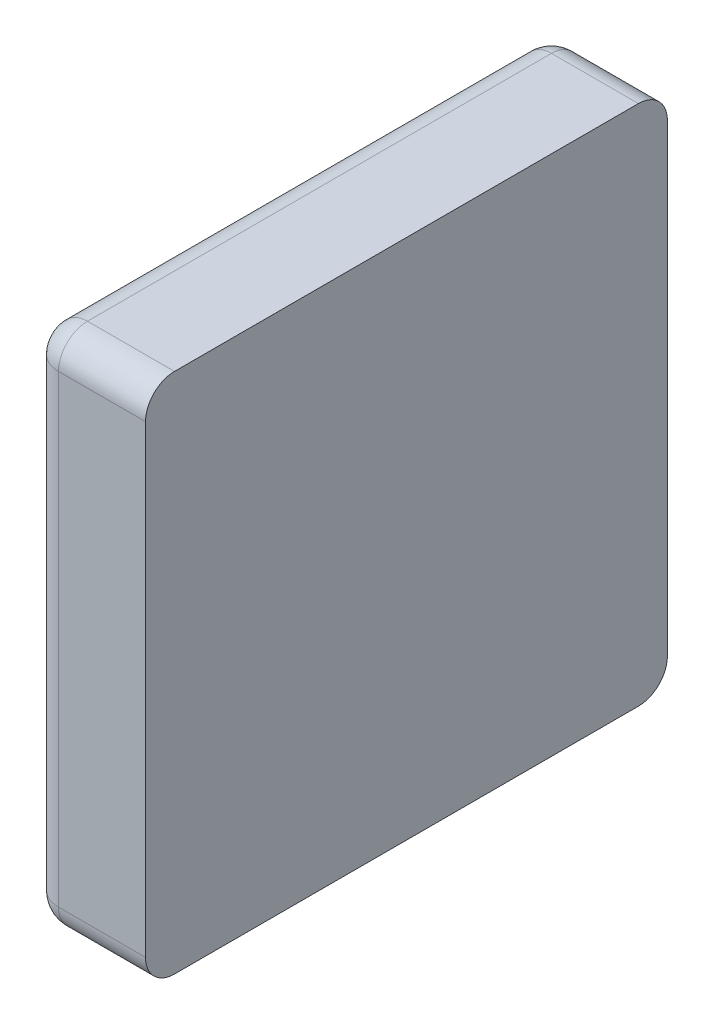
ISO-10303-21;
HEADER;
FILE_DESCRIPTION(('STEP AP214'),'2;1');
FILE_NAME('part.step','',(''),(''),'','','');
FILE_SCHEMA(('AUTOMOTIVE_DESIGN { 1 0 10303 214 1 1 1 1 }'));
ENDSEC;
DATA;
#1=APPLICATION_CONTEXT('core data for automotive mechanical design processes');
#2=APPLICATION_PROTOCOL_DEFINITION('international standard','automotive_design',2000,#1);
#3=PRODUCT_CONTEXT('',#1,'mechanical');
#4=PRODUCT('Part','Part','',(#3));
#5=PRODUCT_RELATED_PRODUCT_CATEGORY('part','',(#4));
#6=PRODUCT_DEFINITION_FORMATION('','',#4);
#7=PRODUCT_DEFINITION_CONTEXT('part definition',#1,'design');
#8=PRODUCT_DEFINITION('design','',#6,#7);
#9=PRODUCT_DEFINITION_SHAPE('','',#8);
#10=(LENGTH_UNIT() NAMED_UNIT(*) SI_UNIT(.MILLI.,.METRE.));
#11=(NAMED_UNIT(*) PLANE_ANGLE_UNIT() SI_UNIT($,.RADIAN.));
#12=(NAMED_UNIT(*) SI_UNIT($,.STERADIAN.) SOLID_ANGLE_UNIT());
#13=UNCERTAINTY_MEASURE_WITH_UNIT(LENGTH_MEASURE(1.E-05),#10,'distance_accuracy_value','');
#14=(GEOMETRIC_REPRESENTATION_CONTEXT(3) GLOBAL_UNCERTAINTY_ASSIGNED_CONTEXT((#13)) GLOBAL_UNIT_ASSIGNED_CONTEXT((#10,
#11,#12)) REPRESENTATION_CONTEXT('',''));
#15=CARTESIAN_POINT('',(0.,0.,0.));
#16=DIRECTION('',(0.,0.,1.));
#17=DIRECTION('',(1.,0.,0.));
#18=AXIS2_PLACEMENT_3D('',#15,#16,#17);
#19=CARTESIAN_POINT('',(0.,0.,0.));
#20=DIRECTION('',(1.,0.,0.));
#21=DIRECTION('',(0.,0.,-1.));
#22=AXIS2_PLACEMENT_3D('',#19,#20,#21);
#23=PLANE('',#22);
#24=DIRECTION('',(0.,0.,1.));
#25=VECTOR('',#24,1.);
#26=CARTESIAN_POINT('',(0.,0.85,0.));
#27=LINE('',#26,#25);
#28=CARTESIAN_POINT('',(0.,0.85,0.05));
#29=VERTEX_POINT('',#28);
#30=CARTESIAN_POINT('',(0.,0.85,0.85));
#31=VERTEX_POINT('',#30);
#32=EDGE_CURVE('E163',#29,#31,#27,.T.);
#33=ORIENTED_EDGE('',*,*,#32,.F.);
#34=DIRECTION('',(0.,1.,0.));
#35=VECTOR('',#34,1.);
#36=CARTESIAN_POINT('',(0.,0.,0.05));
#37=LINE('',#36,#35);
#38=CARTESIAN_POINT('',(0.,0.05,0.05));
#39=VERTEX_POINT('',#38);
#40=EDGE_CURVE('E204',#39,#29,#37,.T.);
#41=ORIENTED_EDGE('',*,*,#40,.F.);
#42=DIRECTION('',(0.,0.,1.));
#43=VECTOR('',#42,1.);
#44=CARTESIAN_POINT('',(0.,0.05,0.));
#45=LINE('',#44,#43);
#46=CARTESIAN_POINT('',(0.,0.05,0.85));
#47=VERTEX_POINT('',#46);
#48=EDGE_CURVE('E205',#47,#39,#45,.F.);
#49=ORIENTED_EDGE('',*,*,#48,.F.);
#50=DIRECTION('',(0.,1.,0.));
#51=VECTOR('',#50,1.);
#52=CARTESIAN_POINT('',(0.,0.,0.85));
#53=LINE('',#52,#51);
#54=EDGE_CURVE('E208',#31,#47,#53,.F.);
#55=ORIENTED_EDGE('',*,*,#54,.F.);
#56=EDGE_LOOP('',(#33,#41,#49,#55));
#57=FACE_BOUND('',#56,.T.);
#58=ADVANCED_FACE('F17',(#57),#23,.F.);
#59=CARTESIAN_POINT('',(0.05,0.05,0.));
#60=DIRECTION('',(0.,0.,1.));
#61=DIRECTION('',(1.,0.,0.));
#62=AXIS2_PLACEMENT_3D('',#59,#60,#61);
#63=CYLINDRICAL_SURFACE('',#62,0.05);
#64=DIRECTION('',(0.,0.,1.));
#65=VECTOR('',#64,1.);
#66=CARTESIAN_POINT('',(0.05,0.,0.));
#67=LINE('',#66,#65);
#68=CARTESIAN_POINT('',(0.05,0.,0.05));
#69=VERTEX_POINT('',#68);
#70=CARTESIAN_POINT('',(0.05,0.,0.850000000000168));
#71=VERTEX_POINT('',#70);
#72=EDGE_CURVE('E273',#69,#71,#67,.T.);
#73=ORIENTED_EDGE('',*,*,#72,.T.);
#74=CARTESIAN_POINT('',(0.05,0.05,0.85));
#75=DIRECTION('',(0.,7.66574547575187E-12,1.));
#76=DIRECTION('',(-1.,0.,0.));
#77=AXIS2_PLACEMENT_3D('',#74,#75,#76);
#78=CIRCLE('',#77,0.05);
#79=EDGE_CURVE('E211',#47,#71,#78,.T.);
#80=ORIENTED_EDGE('',*,*,#79,.F.);
#81=ORIENTED_EDGE('',*,*,#48,.T.);
#82=CARTESIAN_POINT('',(0.05,0.05,0.05));
#83=DIRECTION('',(0.,0.,1.));
#84=DIRECTION('',(-1.,0.,0.));
#85=AXIS2_PLACEMENT_3D('',#82,#83,#84);
#86=CIRCLE('',#85,0.05);
#87=EDGE_CURVE('E201',#69,#39,#86,.F.);
#88=ORIENTED_EDGE('',*,*,#87,.F.);
#89=EDGE_LOOP('',(#73,#80,#81,#88));
#90=FACE_BOUND('',#89,.T.);
#91=ADVANCED_FACE('F194',(#90),#63,.T.);
#92=CARTESIAN_POINT('',(0.05,0.05,0.05));
#93=DIRECTION('',(-1.,0.,0.));
#94=DIRECTION('',(0.,-1.,0.));
#95=AXIS2_PLACEMENT_3D('',#92,#93,#94);
#96=SPHERICAL_SURFACE('',#95,0.05);
#97=CARTESIAN_POINT('',(0.05,0.05,0.05));
#98=DIRECTION('',(1.,0.,0.));
#99=DIRECTION('',(0.,0.,-1.));
#100=AXIS2_PLACEMENT_3D('',#97,#98,#99);
#101=CIRCLE('',#100,0.05);
#102=CARTESIAN_POINT('',(0.05,0.05,0.));
#103=VERTEX_POINT('',#102);
#104=EDGE_CURVE('E73',#69,#103,#101,.T.);
#105=ORIENTED_EDGE('',*,*,#104,.F.);
#106=ORIENTED_EDGE('',*,*,#87,.T.);
#107=CARTESIAN_POINT('',(0.05,0.05,0.05));
#108=DIRECTION('',(0.,1.,0.));
#109=DIRECTION('',(0.,0.,1.));
#110=AXIS2_PLACEMENT_3D('',#107,#108,#109);
#111=CIRCLE('',#110,0.05);
#112=EDGE_CURVE('E224',#103,#39,#111,.T.);
#113=ORIENTED_EDGE('',*,*,#112,.F.);
#114=EDGE_LOOP('',(#105,#106,#113));
#115=FACE_BOUND('',#114,.T.);
#116=ADVANCED_FACE('F190',(#115),#96,.T.);
#117=CARTESIAN_POINT('',(0.05,0.,0.05));
#118=DIRECTION('',(0.,1.,0.));
#119=DIRECTION('',(0.,0.,1.));
#120=AXIS2_PLACEMENT_3D('',#117,#118,#119);
#121=CYLINDRICAL_SURFACE('',#120,0.05);
#122=DIRECTION('',(0.,1.,0.));
#123=VECTOR('',#122,1.);
#124=CARTESIAN_POINT('',(0.05,0.,0.));
#125=LINE('',#124,#123);
#126=CARTESIAN_POINT('',(0.05,0.85,0.));
#127=VERTEX_POINT('',#126);
#128=EDGE_CURVE('E77',#127,#103,#125,.F.);
#129=ORIENTED_EDGE('',*,*,#128,.T.);
#130=ORIENTED_EDGE('',*,*,#112,.T.);
#131=ORIENTED_EDGE('',*,*,#40,.T.);
#132=CARTESIAN_POINT('',(0.05,0.85,0.05));
#133=DIRECTION('',(0.,-1.,0.));
#134=DIRECTION('',(-1.,0.,0.));
#135=AXIS2_PLACEMENT_3D('',#132,#133,#134);
#136=CIRCLE('',#135,0.05);
#137=EDGE_CURVE('E173',#127,#29,#136,.F.);
#138=ORIENTED_EDGE('',*,*,#137,.F.);
#139=EDGE_LOOP('',(#129,#130,#131,#138));
#140=FACE_BOUND('',#139,.T.);
#141=ADVANCED_FACE('F186',(#140),#121,.T.);
#142=CARTESIAN_POINT('',(0.05,0.85,0.05));
#143=DIRECTION('',(-1.,0.,0.));
#144=DIRECTION('',(0.,-1.,0.));
#145=AXIS2_PLACEMENT_3D('',#142,#143,#144);
#146=SPHERICAL_SURFACE('',#145,0.05);
#147=CARTESIAN_POINT('',(0.05,0.85,0.05));
#148=DIRECTION('',(1.,0.,0.));
#149=DIRECTION('',(0.,0.,-1.));
#150=AXIS2_PLACEMENT_3D('',#147,#148,#149);
#151=CIRCLE('',#150,0.05);
#152=CARTESIAN_POINT('',(0.05,0.9,0.05));
#153=VERTEX_POINT('',#152);
#154=EDGE_CURVE('E121',#127,#153,#151,.T.);
#155=ORIENTED_EDGE('',*,*,#154,.F.);
#156=ORIENTED_EDGE('',*,*,#137,.T.);
#157=CARTESIAN_POINT('',(0.05,0.85,0.05));
#158=DIRECTION('',(0.,0.,1.));
#159=DIRECTION('',(1.,0.,0.));
#160=AXIS2_PLACEMENT_3D('',#157,#158,#159);
#161=CIRCLE('',#160,0.05);
#162=EDGE_CURVE('E170',#153,#29,#161,.T.);
#163=ORIENTED_EDGE('',*,*,#162,.F.);
#164=EDGE_LOOP('',(#155,#156,#163));
#165=FACE_BOUND('',#164,.T.);
#166=ADVANCED_FACE('F183',(#165),#146,.T.);
#167=CARTESIAN_POINT('',(0.05,0.85,0.));
#168=DIRECTION('',(0.,0.,1.));
#169=DIRECTION('',(1.,0.,0.));
#170=AXIS2_PLACEMENT_3D('',#167,#168,#169);
#171=CYLINDRICAL_SURFACE('',#170,0.05);
#172=ORIENTED_EDGE('',*,*,#162,.T.);
#173=ORIENTED_EDGE('',*,*,#32,.T.);
#174=CARTESIAN_POINT('',(0.05,0.85,0.85));
#175=DIRECTION('',(0.,0.,-1.));
#176=DIRECTION('',(-1.,0.,0.));
#177=AXIS2_PLACEMENT_3D('',#174,#175,#176);
#178=CIRCLE('',#177,0.05);
#179=CARTESIAN_POINT('',(0.05,0.9,0.85));
#180=VERTEX_POINT('',#179);
#181=EDGE_CURVE('E159',#180,#31,#178,.F.);
#182=ORIENTED_EDGE('',*,*,#181,.F.);
#183=DIRECTION('',(0.,0.,1.));
#184=VECTOR('',#183,1.);
#185=CARTESIAN_POINT('',(0.05,0.9,0.));
#186=LINE('',#185,#184);
#187=EDGE_CURVE('E115',#153,#180,#186,.T.);
#188=ORIENTED_EDGE('',*,*,#187,.F.);
#189=EDGE_LOOP('',(#172,#173,#182,#188));
#190=FACE_BOUND('',#189,.T.);
#191=ADVANCED_FACE('F151',(#190),#171,.T.);
#192=CARTESIAN_POINT('',(0.05,0.85,0.85));
#193=DIRECTION('',(-1.,0.,0.));
#194=DIRECTION('',(0.,0.,-1.));
#195=AXIS2_PLACEMENT_3D('',#192,#193,#194);
#196=SPHERICAL_SURFACE('',#195,0.05);
#197=CARTESIAN_POINT('',(0.05,0.85,0.85));
#198=DIRECTION('',(1.,0.,0.));
#199=DIRECTION('',(0.,0.,-1.));
#200=AXIS2_PLACEMENT_3D('',#197,#198,#199);
#201=CIRCLE('',#200,0.05);
#202=CARTESIAN_POINT('',(0.05,0.85,0.9));
#203=VERTEX_POINT('',#202);
#204=EDGE_CURVE('E114',#180,#203,#201,.T.);
#205=ORIENTED_EDGE('',*,*,#204,.F.);
#206=ORIENTED_EDGE('',*,*,#181,.T.);
#207=CARTESIAN_POINT('',(0.05,0.85,0.85));
#208=DIRECTION('',(0.,1.,0.));
#209=DIRECTION('',(0.,0.,1.));
#210=AXIS2_PLACEMENT_3D('',#207,#208,#209);
#211=CIRCLE('',#210,0.05);
#212=EDGE_CURVE('E162',#203,#31,#211,.F.);
#213=ORIENTED_EDGE('',*,*,#212,.F.);
#214=EDGE_LOOP('',(#205,#206,#213));
#215=FACE_BOUND('',#214,.T.);
#216=ADVANCED_FACE('F146',(#215),#196,.T.);
#217=CARTESIAN_POINT('',(0.05,0.,0.85));
#218=DIRECTION('',(0.,1.,0.));
#219=DIRECTION('',(0.,0.,1.));
#220=AXIS2_PLACEMENT_3D('',#217,#218,#219);
#221=CYLINDRICAL_SURFACE('',#220,0.05);
#222=ORIENTED_EDGE('',*,*,#212,.T.);
#223=ORIENTED_EDGE('',*,*,#54,.T.);
#224=CARTESIAN_POINT('',(0.05,0.05,0.85));
#225=DIRECTION('',(0.,1.,0.));
#226=DIRECTION('',(-1.,0.,0.));
#227=AXIS2_PLACEMENT_3D('',#224,#225,#226);
#228=CIRCLE('',#227,0.05);
#229=CARTESIAN_POINT('',(0.05,0.05,0.9));
#230=VERTEX_POINT('',#229);
#231=EDGE_CURVE('E275',#230,#47,#228,.F.);
#232=ORIENTED_EDGE('',*,*,#231,.F.);
#233=DIRECTION('',(0.,1.,0.));
#234=VECTOR('',#233,1.);
#235=CARTESIAN_POINT('',(0.05,0.,0.9));
#236=LINE('',#235,#234);
#237=EDGE_CURVE('E108',#203,#230,#236,.F.);
#238=ORIENTED_EDGE('',*,*,#237,.F.);
#239=EDGE_LOOP('',(#222,#223,#232,#238));
#240=FACE_BOUND('',#239,.T.);
#241=ADVANCED_FACE('F141',(#240),#221,.T.);
#242=CARTESIAN_POINT('',(0.05,0.05,0.85));
#243=DIRECTION('',(-1.,0.,0.));
#244=DIRECTION('',(0.,1.,0.));
#245=AXIS2_PLACEMENT_3D('',#242,#243,#244);
#246=SPHERICAL_SURFACE('',#245,0.05);
#247=CARTESIAN_POINT('',(0.05,0.05,0.85));
#248=DIRECTION('',(1.,0.,0.));
#249=DIRECTION('',(0.,0.,-1.));
#250=AXIS2_PLACEMENT_3D('',#247,#248,#249);
#251=CIRCLE('',#250,0.05);
#252=EDGE_CURVE('E91',#230,#71,#251,.T.);
#253=ORIENTED_EDGE('',*,*,#252,.F.);
#254=ORIENTED_EDGE('',*,*,#231,.T.);
#255=ORIENTED_EDGE('',*,*,#79,.T.);
#256=EDGE_LOOP('',(#253,#254,#255));
#257=FACE_BOUND('',#256,.T.);
#258=ADVANCED_FACE('F136',(#257),#246,.T.);
#259=CARTESIAN_POINT('',(0.,0.,0.));
#260=DIRECTION('',(0.,1.,0.));
#261=DIRECTION('',(0.,0.,1.));
#262=AXIS2_PLACEMENT_3D('',#259,#260,#261);
#263=PLANE('',#262);
#264=DIRECTION('',(1.,0.,0.));
#265=VECTOR('',#264,1.);
#266=CARTESIAN_POINT('',(0.,0.,0.85));
#267=LINE('',#266,#265);
#268=CARTESIAN_POINT('',(0.2,0.,0.85));
#269=VERTEX_POINT('',#268);
#270=EDGE_CURVE('E97',#71,#269,#267,.T.);
#271=ORIENTED_EDGE('',*,*,#270,.F.);
#272=ORIENTED_EDGE('',*,*,#72,.F.);
#273=DIRECTION('',(1.,0.,0.));
#274=VECTOR('',#273,1.);
#275=CARTESIAN_POINT('',(0.,0.,0.05));
#276=LINE('',#275,#274);
#277=CARTESIAN_POINT('',(0.2,0.,0.05));
#278=VERTEX_POINT('',#277);
#279=EDGE_CURVE('E60',#278,#69,#276,.F.);
#280=ORIENTED_EDGE('',*,*,#279,.F.);
#281=DIRECTION('',(0.,0.,-1.));
#282=VECTOR('',#281,1.);
#283=CARTESIAN_POINT('',(0.2,0.,0.));
#284=LINE('',#283,#282);
#285=EDGE_CURVE('E90',#269,#278,#284,.T.);
#286=ORIENTED_EDGE('',*,*,#285,.F.);
#287=EDGE_LOOP('',(#271,#272,#280,#286));
#288=FACE_BOUND('',#287,.T.);
#289=ADVANCED_FACE('F140',(#288),#263,.F.);
#290=CARTESIAN_POINT('',(0.,0.05,0.05));
#291=DIRECTION('',(1.,0.,0.));
#292=DIRECTION('',(0.,0.,-1.));
#293=AXIS2_PLACEMENT_3D('',#290,#291,#292);
#294=CYLINDRICAL_SURFACE('',#293,0.05);
#295=CARTESIAN_POINT('',(0.2,0.05,0.05));
#296=DIRECTION('',(1.,0.,0.));
#297=DIRECTION('',(0.,0.,-1.));
#298=AXIS2_PLACEMENT_3D('',#295,#296,#297);
#299=CIRCLE('',#298,0.05);
#300=CARTESIAN_POINT('',(0.2,0.05,0.));
#301=VERTEX_POINT('',#300);
#302=EDGE_CURVE('E20',#278,#301,#299,.T.);
#303=ORIENTED_EDGE('',*,*,#302,.F.);
#304=ORIENTED_EDGE('',*,*,#279,.T.);
#305=ORIENTED_EDGE('',*,*,#104,.T.);
#306=DIRECTION('',(1.,0.,0.));
#307=VECTOR('',#306,1.);
#308=CARTESIAN_POINT('',(0.,0.05,0.));
#309=LINE('',#308,#307);
#310=EDGE_CURVE('E66',#103,#301,#309,.T.);
#311=ORIENTED_EDGE('',*,*,#310,.T.);
#312=EDGE_LOOP('',(#303,#304,#305,#311));
#313=FACE_BOUND('',#312,.T.);
#314=ADVANCED_FACE('F68',(#313),#294,.T.);
#315=CARTESIAN_POINT('',(0.,0.,0.));
#316=DIRECTION('',(0.,0.,1.));
#317=DIRECTION('',(1.,0.,0.));
#318=AXIS2_PLACEMENT_3D('',#315,#316,#317);
#319=PLANE('',#318);
#320=DIRECTION('',(0.,1.,0.));
#321=VECTOR('',#320,1.);
#322=CARTESIAN_POINT('',(0.2,0.,0.));
#323=LINE('',#322,#321);
#324=CARTESIAN_POINT('',(0.2,0.85,0.));
#325=VERTEX_POINT('',#324);
#326=EDGE_CURVE('E80',#301,#325,#323,.T.);
#327=ORIENTED_EDGE('',*,*,#326,.F.);
#328=ORIENTED_EDGE('',*,*,#310,.F.);
#329=ORIENTED_EDGE('',*,*,#128,.F.);
#330=DIRECTION('',(1.,0.,0.));
#331=VECTOR('',#330,1.);
#332=CARTESIAN_POINT('',(0.,0.85,0.));
#333=LINE('',#332,#331);
#334=EDGE_CURVE('E76',#325,#127,#333,.F.);
#335=ORIENTED_EDGE('',*,*,#334,.F.);
#336=EDGE_LOOP('',(#327,#328,#329,#335));
#337=FACE_BOUND('',#336,.T.);
#338=ADVANCED_FACE('F81',(#337),#319,.F.);
#339=CARTESIAN_POINT('',(0.,0.85,0.05));
#340=DIRECTION('',(1.,0.,0.));
#341=DIRECTION('',(0.,0.,-1.));
#342=AXIS2_PLACEMENT_3D('',#339,#340,#341);
#343=CYLINDRICAL_SURFACE('',#342,0.05);
#344=ORIENTED_EDGE('',*,*,#334,.T.);
#345=ORIENTED_EDGE('',*,*,#154,.T.);
#346=DIRECTION('',(1.,0.,0.));
#347=VECTOR('',#346,1.);
#348=CARTESIAN_POINT('',(0.,0.9,0.05));
#349=LINE('',#348,#347);
#350=CARTESIAN_POINT('',(0.2,0.9,0.05));
#351=VERTEX_POINT('',#350);
#352=EDGE_CURVE('E118',#351,#153,#349,.F.);
#353=ORIENTED_EDGE('',*,*,#352,.F.);
#354=CARTESIAN_POINT('',(0.2,0.85,0.05));
#355=DIRECTION('',(1.,0.,0.));
#356=DIRECTION('',(0.,0.,-1.));
#357=AXIS2_PLACEMENT_3D('',#354,#355,#356);
#358=CIRCLE('',#357,0.05);
#359=EDGE_CURVE('E86',#325,#351,#358,.T.);
#360=ORIENTED_EDGE('',*,*,#359,.F.);
#361=EDGE_LOOP('',(#344,#345,#353,#360));
#362=FACE_BOUND('',#361,.T.);
#363=ADVANCED_FACE('F326',(#362),#343,.T.);
#364=CARTESIAN_POINT('',(0.,0.9,0.));
#365=DIRECTION('',(0.,1.,0.));
#366=DIRECTION('',(0.,0.,1.));
#367=AXIS2_PLACEMENT_3D('',#364,#365,#366);
#368=PLANE('',#367);
#369=DIRECTION('',(1.,0.,0.));
#370=VECTOR('',#369,1.);
#371=CARTESIAN_POINT('',(0.,0.9,0.85));
#372=LINE('',#371,#370);
#373=CARTESIAN_POINT('',(0.2,0.9,0.85));
#374=VERTEX_POINT('',#373);
#375=EDGE_CURVE('E111',#374,#180,#372,.F.);
#376=ORIENTED_EDGE('',*,*,#375,.F.);
#377=DIRECTION('',(0.,0.,-1.));
#378=VECTOR('',#377,1.);
#379=CARTESIAN_POINT('',(0.2,0.9,0.));
#380=LINE('',#379,#378);
#381=EDGE_CURVE('E229',#351,#374,#380,.F.);
#382=ORIENTED_EDGE('',*,*,#381,.F.);
#383=ORIENTED_EDGE('',*,*,#352,.T.);
#384=ORIENTED_EDGE('',*,*,#187,.T.);
#385=EDGE_LOOP('',(#376,#382,#383,#384));
#386=FACE_BOUND('',#385,.T.);
#387=ADVANCED_FACE('F323',(#386),#368,.T.);
#388=CARTESIAN_POINT('',(0.,0.85,0.85));
#389=DIRECTION('',(1.,0.,0.));
#390=DIRECTION('',(0.,0.,-1.));
#391=AXIS2_PLACEMENT_3D('',#388,#389,#390);
#392=CYLINDRICAL_SURFACE('',#391,0.05);
#393=DIRECTION('',(1.,0.,0.));
#394=VECTOR('',#393,1.);
#395=CARTESIAN_POINT('',(0.,0.85,0.9));
#396=LINE('',#395,#394);
#397=CARTESIAN_POINT('',(0.2,0.85,0.9));
#398=VERTEX_POINT('',#397);
#399=EDGE_CURVE('E100',#398,#203,#396,.F.);
#400=ORIENTED_EDGE('',*,*,#399,.F.);
#401=CARTESIAN_POINT('',(0.2,0.85,0.85));
#402=DIRECTION('',(1.,0.,0.));
#403=DIRECTION('',(0.,0.,-1.));
#404=AXIS2_PLACEMENT_3D('',#401,#402,#403);
#405=CIRCLE('',#404,0.05);
#406=EDGE_CURVE('E227',#374,#398,#405,.T.);
#407=ORIENTED_EDGE('',*,*,#406,.F.);
#408=ORIENTED_EDGE('',*,*,#375,.T.);
#409=ORIENTED_EDGE('',*,*,#204,.T.);
#410=EDGE_LOOP('',(#400,#407,#408,#409));
#411=FACE_BOUND('',#410,.T.);
#412=ADVANCED_FACE('F244',(#411),#392,.T.);
#413=CARTESIAN_POINT('',(0.,0.,0.9));
#414=DIRECTION('',(0.,0.,1.));
#415=DIRECTION('',(1.,0.,0.));
#416=AXIS2_PLACEMENT_3D('',#413,#414,#415);
#417=PLANE('',#416);
#418=DIRECTION('',(0.,1.,0.));
#419=VECTOR('',#418,1.);
#420=CARTESIAN_POINT('',(0.2,0.,0.9));
#421=LINE('',#420,#419);
#422=CARTESIAN_POINT('',(0.2,0.05,0.9));
#423=VERTEX_POINT('',#422);
#424=EDGE_CURVE('E26',#398,#423,#421,.F.);
#425=ORIENTED_EDGE('',*,*,#424,.F.);
#426=ORIENTED_EDGE('',*,*,#399,.T.);
#427=ORIENTED_EDGE('',*,*,#237,.T.);
#428=DIRECTION('',(1.,0.,0.));
#429=VECTOR('',#428,1.);
#430=CARTESIAN_POINT('',(0.,0.05,0.9));
#431=LINE('',#430,#429);
#432=EDGE_CURVE('E35',#423,#230,#431,.F.);
#433=ORIENTED_EDGE('',*,*,#432,.F.);
#434=EDGE_LOOP('',(#425,#426,#427,#433));
#435=FACE_BOUND('',#434,.T.);
#436=ADVANCED_FACE('F234',(#435),#417,.T.);
#437=CARTESIAN_POINT('',(0.,0.05,0.85));
#438=DIRECTION('',(1.,0.,0.));
#439=DIRECTION('',(0.,0.,-1.));
#440=AXIS2_PLACEMENT_3D('',#437,#438,#439);
#441=CYLINDRICAL_SURFACE('',#440,0.05);
#442=ORIENTED_EDGE('',*,*,#432,.T.);
#443=ORIENTED_EDGE('',*,*,#252,.T.);
#444=ORIENTED_EDGE('',*,*,#270,.T.);
#445=CARTESIAN_POINT('',(0.2,0.05,0.85));
#446=DIRECTION('',(1.,0.,0.));
#447=DIRECTION('',(0.,0.,-1.));
#448=AXIS2_PLACEMENT_3D('',#445,#446,#447);
#449=CIRCLE('',#448,0.05);
#450=EDGE_CURVE('E11',#423,#269,#449,.T.);
#451=ORIENTED_EDGE('',*,*,#450,.F.);
#452=EDGE_LOOP('',(#442,#443,#444,#451));
#453=FACE_BOUND('',#452,.T.);
#454=ADVANCED_FACE('F308',(#453),#441,.T.);
#455=CARTESIAN_POINT('',(0.2,0.,0.));
#456=DIRECTION('',(1.,0.,0.));
#457=DIRECTION('',(0.,0.,-1.));
#458=AXIS2_PLACEMENT_3D('',#455,#456,#457);
#459=PLANE('',#458);
#460=ORIENTED_EDGE('',*,*,#424,.T.);
#461=ORIENTED_EDGE('',*,*,#450,.T.);
#462=ORIENTED_EDGE('',*,*,#285,.T.);
#463=ORIENTED_EDGE('',*,*,#302,.T.);
#464=ORIENTED_EDGE('',*,*,#326,.T.);
#465=ORIENTED_EDGE('',*,*,#359,.T.);
#466=ORIENTED_EDGE('',*,*,#381,.T.);
#467=ORIENTED_EDGE('',*,*,#406,.T.);
#468=EDGE_LOOP('',(#460,#461,#462,#463,#464,#465,#466,#467));
#469=FACE_BOUND('',#468,.T.);
#470=ADVANCED_FACE('F89',(#469),#459,.T.);
#471=CLOSED_SHELL('',(#58,#91,#116,#141,#166,#191,#216,#241,#258,#289,#314,#338,#363,#387,#412,
#436,#454,#470));
#472=MANIFOLD_SOLID_BREP('B1',#471);
#473=ADVANCED_BREP_SHAPE_REPRESENTATION('',(#18,#472),#14);
#474=SHAPE_DEFINITION_REPRESENTATION(#9,#473);
ENDSEC;
END-ISO-10303-21;
